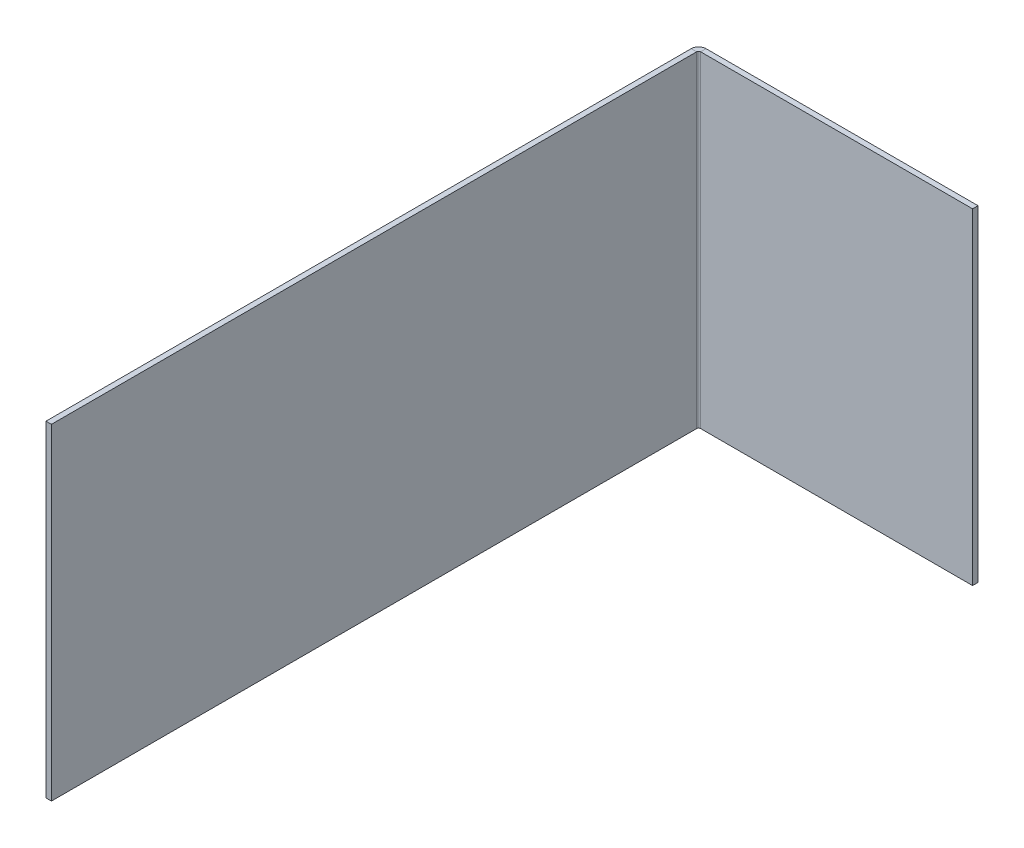
ISO-10303-21;
HEADER;
FILE_DESCRIPTION(('STEP AP214'),'2;1');
FILE_NAME('part.step','',(''),(''),'','','');
FILE_SCHEMA(('AUTOMOTIVE_DESIGN { 1 0 10303 214 1 1 1 1 }'));
ENDSEC;
DATA;
#1=APPLICATION_CONTEXT('core data for automotive mechanical design processes');
#2=APPLICATION_PROTOCOL_DEFINITION('international standard','automotive_design',2000,#1);
#3=PRODUCT_CONTEXT('',#1,'mechanical');
#4=PRODUCT('Part','Part','',(#3));
#5=PRODUCT_RELATED_PRODUCT_CATEGORY('part','',(#4));
#6=PRODUCT_DEFINITION_FORMATION('','',#4);
#7=PRODUCT_DEFINITION_CONTEXT('part definition',#1,'design');
#8=PRODUCT_DEFINITION('design','',#6,#7);
#9=PRODUCT_DEFINITION_SHAPE('','',#8);
#10=(LENGTH_UNIT() NAMED_UNIT(*) SI_UNIT(.MILLI.,.METRE.));
#11=(NAMED_UNIT(*) PLANE_ANGLE_UNIT() SI_UNIT($,.RADIAN.));
#12=(NAMED_UNIT(*) SI_UNIT($,.STERADIAN.) SOLID_ANGLE_UNIT());
#13=UNCERTAINTY_MEASURE_WITH_UNIT(LENGTH_MEASURE(1.E-05),#10,'distance_accuracy_value','');
#14=(GEOMETRIC_REPRESENTATION_CONTEXT(3) GLOBAL_UNCERTAINTY_ASSIGNED_CONTEXT((#13)) GLOBAL_UNIT_ASSIGNED_CONTEXT((#10,
#11,#12)) REPRESENTATION_CONTEXT('',''));
#15=CARTESIAN_POINT('',(0.,0.,0.));
#16=DIRECTION('',(0.,0.,1.));
#17=DIRECTION('',(1.,0.,0.));
#18=AXIS2_PLACEMENT_3D('',#15,#16,#17);
#19=CARTESIAN_POINT('',(50.,60.,-2.));
#20=DIRECTION('',(1.,0.,0.));
#21=DIRECTION('',(0.,1.,0.));
#22=AXIS2_PLACEMENT_3D('',#19,#20,#21);
#23=PLANE('',#22);
#24=DIRECTION('',(0.,1.,0.));
#25=VECTOR('',#24,1.);
#26=CARTESIAN_POINT('',(50.,60.,0.));
#27=LINE('',#26,#25);
#28=CARTESIAN_POINT('',(50.,-60.,0.));
#29=VERTEX_POINT('',#28);
#30=CARTESIAN_POINT('',(50.,60.,0.));
#31=VERTEX_POINT('',#30);
#32=EDGE_CURVE('E209',#29,#31,#27,.T.);
#33=ORIENTED_EDGE('',*,*,#32,.F.);
#34=DIRECTION('',(0.,0.,1.));
#35=VECTOR('',#34,1.);
#36=CARTESIAN_POINT('',(50.,-60.,-2.));
#37=LINE('',#36,#35);
#38=CARTESIAN_POINT('',(50.,-60.,-2.));
#39=VERTEX_POINT('',#38);
#40=EDGE_CURVE('E13',#39,#29,#37,.T.);
#41=ORIENTED_EDGE('',*,*,#40,.F.);
#42=DIRECTION('',(0.,1.,0.));
#43=VECTOR('',#42,1.);
#44=CARTESIAN_POINT('',(50.,60.,-2.));
#45=LINE('',#44,#43);
#46=CARTESIAN_POINT('',(50.,60.,-2.));
#47=VERTEX_POINT('',#46);
#48=EDGE_CURVE('E216',#39,#47,#45,.T.);
#49=ORIENTED_EDGE('',*,*,#48,.T.);
#50=DIRECTION('',(0.,0.,1.));
#51=VECTOR('',#50,1.);
#52=CARTESIAN_POINT('',(50.,60.,-2.));
#53=LINE('',#52,#51);
#54=EDGE_CURVE('E69',#47,#31,#53,.T.);
#55=ORIENTED_EDGE('',*,*,#54,.T.);
#56=EDGE_LOOP('',(#33,#41,#49,#55));
#57=FACE_BOUND('',#56,.T.);
#58=ADVANCED_FACE('F66',(#57),#23,.T.);
#59=CARTESIAN_POINT('',(-50.,-60.,-2.));
#60=DIRECTION('',(0.,-1.,0.));
#61=DIRECTION('',(0.,0.,-1.));
#62=AXIS2_PLACEMENT_3D('',#59,#60,#61);
#63=PLANE('',#62);
#64=DIRECTION('',(1.,0.,0.));
#65=VECTOR('',#64,1.);
#66=CARTESIAN_POINT('',(-50.,-60.,0.));
#67=LINE('',#66,#65);
#68=CARTESIAN_POINT('',(-50.,-60.,0.));
#69=VERTEX_POINT('',#68);
#70=EDGE_CURVE('E220',#69,#29,#67,.T.);
#71=ORIENTED_EDGE('',*,*,#70,.F.);
#72=DIRECTION('',(0.,0.,1.));
#73=VECTOR('',#72,1.);
#74=CARTESIAN_POINT('',(-50.,-60.,-2.));
#75=LINE('',#74,#73);
#76=CARTESIAN_POINT('',(-50.,-60.,-2.));
#77=VERTEX_POINT('',#76);
#78=EDGE_CURVE('E76',#77,#69,#75,.T.);
#79=ORIENTED_EDGE('',*,*,#78,.F.);
#80=DIRECTION('',(1.,0.,0.));
#81=VECTOR('',#80,1.);
#82=CARTESIAN_POINT('',(-50.,-60.,-2.));
#83=LINE('',#82,#81);
#84=EDGE_CURVE('E225',#77,#39,#83,.T.);
#85=ORIENTED_EDGE('',*,*,#84,.T.);
#86=ORIENTED_EDGE('',*,*,#40,.T.);
#87=EDGE_LOOP('',(#71,#79,#85,#86));
#88=FACE_BOUND('',#87,.T.);
#89=ADVANCED_FACE('F246',(#88),#63,.T.);
#90=CARTESIAN_POINT('',(-50.,60.,-2.));
#91=DIRECTION('',(0.,1.,0.));
#92=DIRECTION('',(0.,0.,1.));
#93=AXIS2_PLACEMENT_3D('',#90,#91,#92);
#94=PLANE('',#93);
#95=DIRECTION('',(-1.,0.,0.));
#96=VECTOR('',#95,1.);
#97=CARTESIAN_POINT('',(-50.,60.,0.));
#98=LINE('',#97,#96);
#99=CARTESIAN_POINT('',(-50.,60.,0.));
#100=VERTEX_POINT('',#99);
#101=EDGE_CURVE('E231',#31,#100,#98,.T.);
#102=ORIENTED_EDGE('',*,*,#101,.F.);
#103=ORIENTED_EDGE('',*,*,#54,.F.);
#104=DIRECTION('',(-1.,0.,0.));
#105=VECTOR('',#104,1.);
#106=CARTESIAN_POINT('',(-50.,60.,-2.));
#107=LINE('',#106,#105);
#108=CARTESIAN_POINT('',(-50.,60.,-2.));
#109=VERTEX_POINT('',#108);
#110=EDGE_CURVE('E219',#47,#109,#107,.T.);
#111=ORIENTED_EDGE('',*,*,#110,.T.);
#112=DIRECTION('',(0.,0.,1.));
#113=VECTOR('',#112,1.);
#114=CARTESIAN_POINT('',(-50.,60.,-2.));
#115=LINE('',#114,#113);
#116=EDGE_CURVE('E239',#109,#100,#115,.T.);
#117=ORIENTED_EDGE('',*,*,#116,.T.);
#118=EDGE_LOOP('',(#102,#103,#111,#117));
#119=FACE_BOUND('',#118,.T.);
#120=ADVANCED_FACE('F243',(#119),#94,.T.);
#121=CARTESIAN_POINT('',(0.,0.,-2.));
#122=DIRECTION('',(0.,0.,1.));
#123=DIRECTION('',(1.,0.,0.));
#124=AXIS2_PLACEMENT_3D('',#121,#122,#123);
#125=PLANE('',#124);
#126=ORIENTED_EDGE('',*,*,#48,.F.);
#127=ORIENTED_EDGE('',*,*,#84,.F.);
#128=DIRECTION('',(0.,-1.,0.));
#129=VECTOR('',#128,1.);
#130=CARTESIAN_POINT('',(-50.,60.,-2.));
#131=LINE('',#130,#129);
#132=EDGE_CURVE('E147',#109,#77,#131,.T.);
#133=ORIENTED_EDGE('',*,*,#132,.F.);
#134=ORIENTED_EDGE('',*,*,#110,.F.);
#135=EDGE_LOOP('',(#126,#127,#133,#134));
#136=FACE_BOUND('',#135,.T.);
#137=ADVANCED_FACE('F277',(#136),#125,.F.);
#138=CARTESIAN_POINT('',(0.,0.,0.));
#139=DIRECTION('',(0.,0.,1.));
#140=DIRECTION('',(1.,0.,0.));
#141=AXIS2_PLACEMENT_3D('',#138,#139,#140);
#142=PLANE('',#141);
#143=ORIENTED_EDGE('',*,*,#32,.T.);
#144=ORIENTED_EDGE('',*,*,#101,.T.);
#145=DIRECTION('',(0.,-1.,0.));
#146=VECTOR('',#145,1.);
#147=CARTESIAN_POINT('',(-50.,60.,0.));
#148=LINE('',#147,#146);
#149=EDGE_CURVE('E102',#100,#69,#148,.T.);
#150=ORIENTED_EDGE('',*,*,#149,.T.);
#151=ORIENTED_EDGE('',*,*,#70,.T.);
#152=EDGE_LOOP('',(#143,#144,#150,#151));
#153=FACE_BOUND('',#152,.T.);
#154=ADVANCED_FACE('F244',(#153),#142,.T.);
#155=CARTESIAN_POINT('',(-50.,60.,0.736599999999999));
#156=DIRECTION('',(0.,1.,0.));
#157=DIRECTION('',(0.,0.,1.));
#158=AXIS2_PLACEMENT_3D('',#155,#156,#157);
#159=PLANE('',#158);
#160=DIRECTION('',(-1.,0.,0.));
#161=VECTOR('',#160,1.);
#162=CARTESIAN_POINT('',(-52.7366,60.,0.736600000000004));
#163=LINE('',#162,#161);
#164=CARTESIAN_POINT('',(-50.7366,60.,0.736599999999996));
#165=VERTEX_POINT('',#164);
#166=CARTESIAN_POINT('',(-52.7366,59.9999999999999,0.736599999999989));
#167=VERTEX_POINT('',#166);
#168=EDGE_CURVE('E204',#165,#167,#163,.T.);
#169=ORIENTED_EDGE('',*,*,#168,.F.);
#170=CARTESIAN_POINT('',(-50.,60.,0.736599999999999));
#171=DIRECTION('',(0.,-1.,0.));
#172=DIRECTION('',(0.,0.,-1.));
#173=AXIS2_PLACEMENT_3D('',#170,#171,#172);
#174=CIRCLE('',#173,0.736600000000004);
#175=EDGE_CURVE('E152',#100,#165,#174,.F.);
#176=ORIENTED_EDGE('',*,*,#175,.F.);
#177=ORIENTED_EDGE('',*,*,#116,.F.);
#178=CARTESIAN_POINT('',(-50.,59.9999999999999,0.736599999999999));
#179=DIRECTION('',(0.,-1.,0.));
#180=DIRECTION('',(0.,0.,-1.));
#181=AXIS2_PLACEMENT_3D('',#178,#179,#180);
#182=CIRCLE('',#181,2.7366);
#183=EDGE_CURVE('E151',#109,#167,#182,.F.);
#184=ORIENTED_EDGE('',*,*,#183,.T.);
#185=EDGE_LOOP('',(#169,#176,#177,#184));
#186=FACE_BOUND('',#185,.T.);
#187=ADVANCED_FACE('F281',(#186),#159,.T.);
#188=CARTESIAN_POINT('',(-50.,-60.,0.736600000000007));
#189=DIRECTION('',(0.,1.,0.));
#190=DIRECTION('',(0.,0.,1.));
#191=AXIS2_PLACEMENT_3D('',#188,#189,#190);
#192=PLANE('',#191);
#193=CARTESIAN_POINT('',(-50.,-60.,0.736600000000007));
#194=DIRECTION('',(0.,-1.,0.));
#195=DIRECTION('',(0.,0.,-1.));
#196=AXIS2_PLACEMENT_3D('',#193,#194,#195);
#197=CIRCLE('',#196,0.736600000000004);
#198=CARTESIAN_POINT('',(-50.7366,-60.,0.736600000000005));
#199=VERTEX_POINT('',#198);
#200=EDGE_CURVE('E159',#199,#69,#197,.T.);
#201=ORIENTED_EDGE('',*,*,#200,.F.);
#202=DIRECTION('',(-1.,0.,0.));
#203=VECTOR('',#202,1.);
#204=CARTESIAN_POINT('',(-50.7366,-60.,0.736600000000004));
#205=LINE('',#204,#203);
#206=CARTESIAN_POINT('',(-52.7366,-60.,0.736599999999997));
#207=VERTEX_POINT('',#206);
#208=EDGE_CURVE('E156',#199,#207,#205,.T.);
#209=ORIENTED_EDGE('',*,*,#208,.T.);
#210=CARTESIAN_POINT('',(-50.,-60.,0.736600000000007));
#211=DIRECTION('',(0.,-1.,0.));
#212=DIRECTION('',(0.,0.,-1.));
#213=AXIS2_PLACEMENT_3D('',#210,#211,#212);
#214=CIRCLE('',#213,2.7366);
#215=EDGE_CURVE('E140',#207,#77,#214,.T.);
#216=ORIENTED_EDGE('',*,*,#215,.T.);
#217=ORIENTED_EDGE('',*,*,#78,.T.);
#218=EDGE_LOOP('',(#201,#209,#216,#217));
#219=FACE_BOUND('',#218,.T.);
#220=ADVANCED_FACE('F157',(#219),#192,.F.);
#221=CARTESIAN_POINT('',(-50.,-60.,0.736600000000007));
#222=DIRECTION('',(0.,-1.,0.));
#223=DIRECTION('',(-1.,0.,0.));
#224=AXIS2_PLACEMENT_3D('',#221,#222,#223);
#225=CYLINDRICAL_SURFACE('',#224,2.7366);
#226=ORIENTED_EDGE('',*,*,#132,.T.);
#227=ORIENTED_EDGE('',*,*,#215,.F.);
#228=DIRECTION('',(0.,-1.,0.));
#229=VECTOR('',#228,1.);
#230=CARTESIAN_POINT('',(-52.7366,0.,0.736599999999993));
#231=LINE('',#230,#229);
#232=EDGE_CURVE('E145',#167,#207,#231,.T.);
#233=ORIENTED_EDGE('',*,*,#232,.F.);
#234=ORIENTED_EDGE('',*,*,#183,.F.);
#235=EDGE_LOOP('',(#226,#227,#233,#234));
#236=FACE_BOUND('',#235,.T.);
#237=ADVANCED_FACE('F142',(#236),#225,.T.);
#238=CARTESIAN_POINT('',(-50.,-60.,0.736600000000007));
#239=DIRECTION('',(0.,-1.,0.));
#240=DIRECTION('',(-1.,0.,0.));
#241=AXIS2_PLACEMENT_3D('',#238,#239,#240);
#242=CYLINDRICAL_SURFACE('',#241,0.736600000000004);
#243=ORIENTED_EDGE('',*,*,#149,.F.);
#244=ORIENTED_EDGE('',*,*,#175,.T.);
#245=DIRECTION('',(0.,1.,0.));
#246=VECTOR('',#245,1.);
#247=CARTESIAN_POINT('',(-50.7366,60.,0.736599999999997));
#248=LINE('',#247,#246);
#249=EDGE_CURVE('E165',#165,#199,#248,.F.);
#250=ORIENTED_EDGE('',*,*,#249,.T.);
#251=ORIENTED_EDGE('',*,*,#200,.T.);
#252=EDGE_LOOP('',(#243,#244,#250,#251));
#253=FACE_BOUND('',#252,.T.);
#254=ADVANCED_FACE('F248',(#253),#242,.F.);
#255=CARTESIAN_POINT('',(-52.7366,-60.,0.));
#256=DIRECTION('',(0.,-1.,0.));
#257=DIRECTION('',(1.,0.,0.));
#258=AXIS2_PLACEMENT_3D('',#255,#256,#257);
#259=PLANE('',#258);
#260=DIRECTION('',(0.,0.,-1.));
#261=VECTOR('',#260,1.);
#262=CARTESIAN_POINT('',(-52.7366,-60.,0.));
#263=LINE('',#262,#261);
#264=CARTESIAN_POINT('',(-52.7366000000008,-60.,238.));
#265=VERTEX_POINT('',#264);
#266=EDGE_CURVE('E172',#265,#207,#263,.T.);
#267=ORIENTED_EDGE('',*,*,#266,.T.);
#268=ORIENTED_EDGE('',*,*,#208,.F.);
#269=DIRECTION('',(0.,0.,1.));
#270=VECTOR('',#269,1.);
#271=CARTESIAN_POINT('',(-50.7366,-60.,-1.74930098417829E-13));
#272=LINE('',#271,#270);
#273=CARTESIAN_POINT('',(-50.7366000000008,-60.,238.));
#274=VERTEX_POINT('',#273);
#275=EDGE_CURVE('E193',#274,#199,#272,.F.);
#276=ORIENTED_EDGE('',*,*,#275,.F.);
#277=DIRECTION('',(1.,0.,0.));
#278=VECTOR('',#277,1.);
#279=CARTESIAN_POINT('',(-52.7366000000008,-60.,238.));
#280=LINE('',#279,#278);
#281=EDGE_CURVE('E178',#265,#274,#280,.T.);
#282=ORIENTED_EDGE('',*,*,#281,.F.);
#283=EDGE_LOOP('',(#267,#268,#276,#282));
#284=FACE_BOUND('',#283,.T.);
#285=ADVANCED_FACE('F177',(#284),#259,.T.);
#286=CARTESIAN_POINT('',(-52.7366000000008,60.,238.));
#287=DIRECTION('',(0.,1.,0.));
#288=DIRECTION('',(0.,0.,1.));
#289=AXIS2_PLACEMENT_3D('',#286,#287,#288);
#290=PLANE('',#289);
#291=DIRECTION('',(0.,0.,-1.));
#292=VECTOR('',#291,1.);
#293=CARTESIAN_POINT('',(-50.7366,60.,-1.67932894481116E-13));
#294=LINE('',#293,#292);
#295=CARTESIAN_POINT('',(-50.7366000000008,60.,238.));
#296=VERTEX_POINT('',#295);
#297=EDGE_CURVE('E175',#165,#296,#294,.F.);
#298=ORIENTED_EDGE('',*,*,#297,.F.);
#299=ORIENTED_EDGE('',*,*,#168,.T.);
#300=DIRECTION('',(0.,0.,1.));
#301=VECTOR('',#300,1.);
#302=CARTESIAN_POINT('',(-52.7366000000008,60.,238.));
#303=LINE('',#302,#301);
#304=CARTESIAN_POINT('',(-52.7366000000008,60.,238.));
#305=VERTEX_POINT('',#304);
#306=EDGE_CURVE('E173',#167,#305,#303,.T.);
#307=ORIENTED_EDGE('',*,*,#306,.T.);
#308=DIRECTION('',(1.,0.,0.));
#309=VECTOR('',#308,1.);
#310=CARTESIAN_POINT('',(-52.7366000000008,60.,238.));
#311=LINE('',#310,#309);
#312=EDGE_CURVE('E181',#305,#296,#311,.T.);
#313=ORIENTED_EDGE('',*,*,#312,.T.);
#314=EDGE_LOOP('',(#298,#299,#307,#313));
#315=FACE_BOUND('',#314,.T.);
#316=ADVANCED_FACE('F255',(#315),#290,.T.);
#317=CARTESIAN_POINT('',(-52.7366,0.,-1.81913061095516E-13));
#318=DIRECTION('',(-1.,0.,0.));
#319=DIRECTION('',(0.,0.,1.));
#320=AXIS2_PLACEMENT_3D('',#317,#318,#319);
#321=PLANE('',#320);
#322=ORIENTED_EDGE('',*,*,#306,.F.);
#323=ORIENTED_EDGE('',*,*,#232,.T.);
#324=ORIENTED_EDGE('',*,*,#266,.F.);
#325=DIRECTION('',(0.,-1.,0.));
#326=VECTOR('',#325,1.);
#327=CARTESIAN_POINT('',(-52.7366000000008,-60.,238.));
#328=LINE('',#327,#326);
#329=EDGE_CURVE('E182',#305,#265,#328,.T.);
#330=ORIENTED_EDGE('',*,*,#329,.F.);
#331=EDGE_LOOP('',(#322,#323,#324,#330));
#332=FACE_BOUND('',#331,.T.);
#333=ADVANCED_FACE('F170',(#332),#321,.T.);
#334=CARTESIAN_POINT('',(-50.7366,0.,-1.74930098417829E-13));
#335=DIRECTION('',(-1.,0.,0.));
#336=DIRECTION('',(0.,0.,1.));
#337=AXIS2_PLACEMENT_3D('',#334,#335,#336);
#338=PLANE('',#337);
#339=ORIENTED_EDGE('',*,*,#249,.F.);
#340=ORIENTED_EDGE('',*,*,#297,.T.);
#341=DIRECTION('',(0.,1.,0.));
#342=VECTOR('',#341,1.);
#343=CARTESIAN_POINT('',(-50.7366000000008,0.,238.));
#344=LINE('',#343,#342);
#345=EDGE_CURVE('E196',#296,#274,#344,.F.);
#346=ORIENTED_EDGE('',*,*,#345,.T.);
#347=ORIENTED_EDGE('',*,*,#275,.T.);
#348=EDGE_LOOP('',(#339,#340,#346,#347));
#349=FACE_BOUND('',#348,.T.);
#350=ADVANCED_FACE('F253',(#349),#338,.F.);
#351=CARTESIAN_POINT('',(-52.7366000000008,-60.,238.));
#352=DIRECTION('',(0.,0.,1.));
#353=DIRECTION('',(1.,0.,0.));
#354=AXIS2_PLACEMENT_3D('',#351,#352,#353);
#355=PLANE('',#354);
#356=ORIENTED_EDGE('',*,*,#345,.F.);
#357=ORIENTED_EDGE('',*,*,#312,.F.);
#358=ORIENTED_EDGE('',*,*,#329,.T.);
#359=ORIENTED_EDGE('',*,*,#281,.T.);
#360=EDGE_LOOP('',(#356,#357,#358,#359));
#361=FACE_BOUND('',#360,.T.);
#362=ADVANCED_FACE('F259',(#361),#355,.T.);
#363=CLOSED_SHELL('',(#58,#89,#120,#137,#154,#187,#220,#237,#254,#285,#316,#333,#350,#362));
#364=MANIFOLD_SOLID_BREP('B2',#363);
#365=ADVANCED_BREP_SHAPE_REPRESENTATION('',(#18,#364),#14);
#366=SHAPE_DEFINITION_REPRESENTATION(#9,#365);
ENDSEC;
END-ISO-10303-21;
